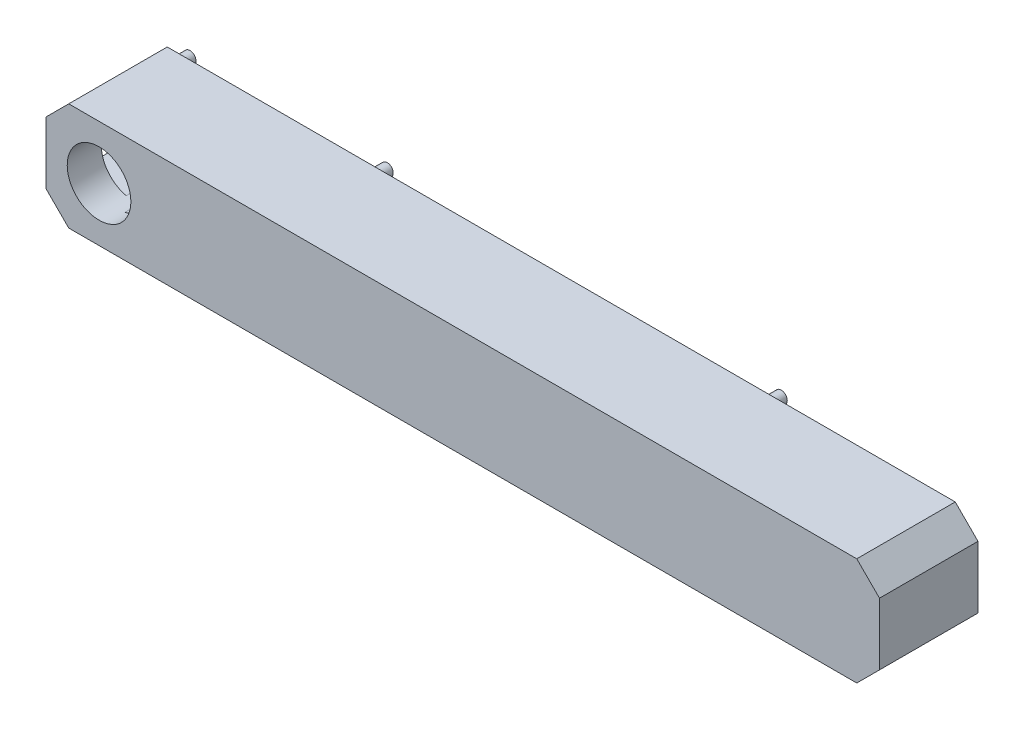
ISO-10303-21;
HEADER;
FILE_DESCRIPTION(('STEP AP214'),'2;1');
FILE_NAME('part.step','',(''),(''),'','','');
FILE_SCHEMA(('AUTOMOTIVE_DESIGN { 1 0 10303 214 1 1 1 1 }'));
ENDSEC;
DATA;
#1=APPLICATION_CONTEXT('core data for automotive mechanical design processes');
#2=APPLICATION_PROTOCOL_DEFINITION('international standard','automotive_design',2000,#1);
#3=PRODUCT_CONTEXT('',#1,'mechanical');
#4=PRODUCT('Part','Part','',(#3));
#5=PRODUCT_RELATED_PRODUCT_CATEGORY('part','',(#4));
#6=PRODUCT_DEFINITION_FORMATION('','',#4);
#7=PRODUCT_DEFINITION_CONTEXT('part definition',#1,'design');
#8=PRODUCT_DEFINITION('design','',#6,#7);
#9=PRODUCT_DEFINITION_SHAPE('','',#8);
#10=(LENGTH_UNIT() NAMED_UNIT(*) SI_UNIT(.MILLI.,.METRE.));
#11=(NAMED_UNIT(*) PLANE_ANGLE_UNIT() SI_UNIT($,.RADIAN.));
#12=(NAMED_UNIT(*) SI_UNIT($,.STERADIAN.) SOLID_ANGLE_UNIT());
#13=UNCERTAINTY_MEASURE_WITH_UNIT(LENGTH_MEASURE(1.E-05),#10,'distance_accuracy_value','');
#14=(GEOMETRIC_REPRESENTATION_CONTEXT(3) GLOBAL_UNCERTAINTY_ASSIGNED_CONTEXT((#13)) GLOBAL_UNIT_ASSIGNED_CONTEXT((#10,
#11,#12)) REPRESENTATION_CONTEXT('',''));
#15=CARTESIAN_POINT('',(0.,0.,0.));
#16=DIRECTION('',(0.,0.,1.));
#17=DIRECTION('',(1.,0.,0.));
#18=AXIS2_PLACEMENT_3D('',#15,#16,#17);
#19=CARTESIAN_POINT('',(-57.0557961783439,0.,2.5));
#20=DIRECTION('',(-1.,0.,0.));
#21=DIRECTION('',(0.,0.,1.));
#22=AXIS2_PLACEMENT_3D('',#19,#20,#21);
#23=PLANE('',#22);
#24=DIRECTION('',(0.,0.,-1.));
#25=VECTOR('',#24,1.);
#26=CARTESIAN_POINT('',(-57.0557961783439,0.,2.5));
#27=LINE('',#26,#25);
#28=CARTESIAN_POINT('',(-57.0557961783439,0.,2.5));
#29=VERTEX_POINT('',#28);
#30=CARTESIAN_POINT('',(-57.0557961783439,0.,-2.));
#31=VERTEX_POINT('',#30);
#32=EDGE_CURVE('E187',#29,#31,#27,.T.);
#33=ORIENTED_EDGE('',*,*,#32,.T.);
#34=DIRECTION('',(0.,-1.,0.));
#35=VECTOR('',#34,1.);
#36=CARTESIAN_POINT('',(-57.0557961783439,0.,-2.));
#37=LINE('',#36,#35);
#38=CARTESIAN_POINT('',(-57.0557961783439,-8.2,-2.));
#39=VERTEX_POINT('',#38);
#40=EDGE_CURVE('E159',#31,#39,#37,.T.);
#41=ORIENTED_EDGE('',*,*,#40,.T.);
#42=DIRECTION('',(0.,0.,-1.));
#43=VECTOR('',#42,1.);
#44=CARTESIAN_POINT('',(-57.0557961783439,-8.2,2.5));
#45=LINE('',#44,#43);
#46=CARTESIAN_POINT('',(-57.0557961783439,-8.2,2.5));
#47=VERTEX_POINT('',#46);
#48=EDGE_CURVE('E179',#47,#39,#45,.T.);
#49=ORIENTED_EDGE('',*,*,#48,.F.);
#50=DIRECTION('',(0.,1.,0.));
#51=VECTOR('',#50,1.);
#52=CARTESIAN_POINT('',(-57.0557961783439,0.,2.5));
#53=LINE('',#52,#51);
#54=EDGE_CURVE('E325',#47,#29,#53,.T.);
#55=ORIENTED_EDGE('',*,*,#54,.T.);
#56=EDGE_LOOP('',(#33,#41,#49,#55));
#57=FACE_BOUND('',#56,.T.);
#58=ADVANCED_FACE('F45',(#57),#23,.T.);
#59=CARTESIAN_POINT('',(-50.0557961783439,-4.1,2.5));
#60=DIRECTION('',(0.,0.,-1.));
#61=DIRECTION('',(-1.,0.,0.));
#62=AXIS2_PLACEMENT_3D('',#59,#60,#61);
#63=CYLINDRICAL_SURFACE('',#62,4.2);
#64=DIRECTION('',(0.,0.,-1.));
#65=VECTOR('',#64,1.);
#66=CARTESIAN_POINT('',(-50.9668395362584,0.,2.5));
#67=LINE('',#66,#65);
#68=CARTESIAN_POINT('',(-50.9668395362584,0.,-10.5));
#69=VERTEX_POINT('',#68);
#70=CARTESIAN_POINT('',(-50.9668395362584,0.,-2.));
#71=VERTEX_POINT('',#70);
#72=EDGE_CURVE('E459',#69,#71,#67,.F.);
#73=ORIENTED_EDGE('',*,*,#72,.F.);
#74=CARTESIAN_POINT('',(-50.0557961783439,-4.1,-10.5));
#75=DIRECTION('',(0.,0.,1.));
#76=DIRECTION('',(1.,0.,0.));
#77=AXIS2_PLACEMENT_3D('',#74,#75,#76);
#78=CIRCLE('',#77,4.2);
#79=CARTESIAN_POINT('',(-49.1447528204295,0.,-10.5));
#80=VERTEX_POINT('',#79);
#81=EDGE_CURVE('E236',#80,#69,#78,.T.);
#82=ORIENTED_EDGE('',*,*,#81,.F.);
#83=DIRECTION('',(0.,0.,1.));
#84=VECTOR('',#83,1.);
#85=CARTESIAN_POINT('',(-49.1447528204295,0.,-10.5));
#86=LINE('',#85,#84);
#87=CARTESIAN_POINT('',(-49.1447528204295,0.,0.));
#88=VERTEX_POINT('',#87);
#89=EDGE_CURVE('E278',#80,#88,#86,.T.);
#90=ORIENTED_EDGE('',*,*,#89,.T.);
#91=CARTESIAN_POINT('',(-50.0557961783439,-4.1,0.));
#92=DIRECTION('',(0.,0.,1.));
#93=DIRECTION('',(1.,0.,0.));
#94=AXIS2_PLACEMENT_3D('',#91,#92,#93);
#95=CIRCLE('',#94,4.2);
#96=CARTESIAN_POINT('',(-49.1447528204295,-8.2,0.));
#97=VERTEX_POINT('',#96);
#98=EDGE_CURVE('E292',#97,#88,#95,.T.);
#99=ORIENTED_EDGE('',*,*,#98,.F.);
#100=DIRECTION('',(0.,0.,1.));
#101=VECTOR('',#100,1.);
#102=CARTESIAN_POINT('',(-49.1447528204295,-8.2,-10.5));
#103=LINE('',#102,#101);
#104=CARTESIAN_POINT('',(-49.1447528204295,-8.2,-10.5));
#105=VERTEX_POINT('',#104);
#106=EDGE_CURVE('E289',#105,#97,#103,.T.);
#107=ORIENTED_EDGE('',*,*,#106,.F.);
#108=CARTESIAN_POINT('',(-50.9668395362584,-8.2,-10.5));
#109=VERTEX_POINT('',#108);
#110=EDGE_CURVE('E241',#109,#105,#78,.T.);
#111=ORIENTED_EDGE('',*,*,#110,.F.);
#112=DIRECTION('',(0.,0.,-1.));
#113=VECTOR('',#112,1.);
#114=CARTESIAN_POINT('',(-50.9668395362584,-8.2,2.5));
#115=LINE('',#114,#113);
#116=CARTESIAN_POINT('',(-50.9668395362584,-8.2,-2.));
#117=VERTEX_POINT('',#116);
#118=EDGE_CURVE('E443',#117,#109,#115,.T.);
#119=ORIENTED_EDGE('',*,*,#118,.F.);
#120=CARTESIAN_POINT('',(-50.0557961783439,-4.1,-2.));
#121=DIRECTION('',(0.,0.,-1.));
#122=DIRECTION('',(-1.,0.,0.));
#123=AXIS2_PLACEMENT_3D('',#120,#121,#122);
#124=CIRCLE('',#123,4.2);
#125=EDGE_CURVE('E160',#117,#71,#124,.T.);
#126=ORIENTED_EDGE('',*,*,#125,.T.);
#127=EDGE_LOOP('',(#73,#82,#90,#99,#107,#111,#119,#126));
#128=FACE_BOUND('',#127,.T.);
#129=CARTESIAN_POINT('',(-50.0557961783439,-4.1,2.5));
#130=DIRECTION('',(0.,0.,1.));
#131=DIRECTION('',(1.,0.,0.));
#132=AXIS2_PLACEMENT_3D('',#129,#130,#131);
#133=CIRCLE('',#132,4.2);
#134=CARTESIAN_POINT('',(-45.8557961783439,-4.1,2.5));
#135=VERTEX_POINT('',#134);
#136=EDGE_CURVE('E302',#135,#135,#133,.T.);
#137=ORIENTED_EDGE('',*,*,#136,.T.);
#138=EDGE_LOOP('',(#137));
#139=FACE_BOUND('',#138,.T.);
#140=ADVANCED_FACE('F47',(#128,#139),#63,.F.);
#141=CARTESIAN_POINT('',(30.5721019108281,-30.572101910828,2.5));
#142=DIRECTION('',(0.707106781186548,-0.707106781186547,0.));
#143=DIRECTION('',(0.707106781186547,0.707106781186548,0.));
#144=AXIS2_PLACEMENT_3D('',#141,#142,#143);
#145=PLANE('',#144);
#146=DIRECTION('',(0.,0.,-1.));
#147=VECTOR('',#146,1.);
#148=CARTESIAN_POINT('',(49.9442038216561,-11.2,2.5));
#149=LINE('',#148,#147);
#150=CARTESIAN_POINT('',(49.9442038216561,-11.2,2.5));
#151=VERTEX_POINT('',#150);
#152=CARTESIAN_POINT('',(49.9442038216561,-11.2,-10.5));
#153=VERTEX_POINT('',#152);
#154=EDGE_CURVE('E334',#151,#153,#149,.T.);
#155=ORIENTED_EDGE('',*,*,#154,.T.);
#156=DIRECTION('',(-0.707106781186547,-0.707106781186548,0.));
#157=VECTOR('',#156,1.);
#158=CARTESIAN_POINT('',(30.5721019108281,-30.572101910828,-10.5));
#159=LINE('',#158,#157);
#160=CARTESIAN_POINT('',(52.9442038216561,-8.2,-10.5));
#161=VERTEX_POINT('',#160);
#162=EDGE_CURVE('E251',#161,#153,#159,.T.);
#163=ORIENTED_EDGE('',*,*,#162,.F.);
#164=DIRECTION('',(0.,0.,-1.));
#165=VECTOR('',#164,1.);
#166=CARTESIAN_POINT('',(52.9442038216561,-8.2,2.5));
#167=LINE('',#166,#165);
#168=CARTESIAN_POINT('',(52.9442038216561,-8.2,2.5));
#169=VERTEX_POINT('',#168);
#170=EDGE_CURVE('E352',#169,#161,#167,.T.);
#171=ORIENTED_EDGE('',*,*,#170,.F.);
#172=DIRECTION('',(-0.707106781186547,-0.707106781186548,0.));
#173=VECTOR('',#172,1.);
#174=CARTESIAN_POINT('',(30.5721019108281,-30.572101910828,2.5));
#175=LINE('',#174,#173);
#176=EDGE_CURVE('E306',#169,#151,#175,.T.);
#177=ORIENTED_EDGE('',*,*,#176,.T.);
#178=EDGE_LOOP('',(#155,#163,#171,#177));
#179=FACE_BOUND('',#178,.T.);
#180=ADVANCED_FACE('F397',(#179),#145,.T.);
#181=CARTESIAN_POINT('',(52.9442038216561,0.,2.5));
#182=DIRECTION('',(1.,0.,0.));
#183=DIRECTION('',(0.,0.,-1.));
#184=AXIS2_PLACEMENT_3D('',#181,#182,#183);
#185=PLANE('',#184);
#186=ORIENTED_EDGE('',*,*,#170,.T.);
#187=DIRECTION('',(0.,-1.,0.));
#188=VECTOR('',#187,1.);
#189=CARTESIAN_POINT('',(52.9442038216561,0.,-10.5));
#190=LINE('',#189,#188);
#191=CARTESIAN_POINT('',(52.9442038216561,0.,-10.5));
#192=VERTEX_POINT('',#191);
#193=EDGE_CURVE('E255',#192,#161,#190,.T.);
#194=ORIENTED_EDGE('',*,*,#193,.F.);
#195=DIRECTION('',(0.,0.,-1.));
#196=VECTOR('',#195,1.);
#197=CARTESIAN_POINT('',(52.9442038216561,0.,2.5));
#198=LINE('',#197,#196);
#199=CARTESIAN_POINT('',(52.9442038216561,0.,2.5));
#200=VERTEX_POINT('',#199);
#201=EDGE_CURVE('E349',#200,#192,#198,.T.);
#202=ORIENTED_EDGE('',*,*,#201,.F.);
#203=DIRECTION('',(0.,-1.,0.));
#204=VECTOR('',#203,1.);
#205=CARTESIAN_POINT('',(52.9442038216561,0.,2.5));
#206=LINE('',#205,#204);
#207=EDGE_CURVE('E310',#200,#169,#206,.T.);
#208=ORIENTED_EDGE('',*,*,#207,.T.);
#209=EDGE_LOOP('',(#186,#194,#202,#208));
#210=FACE_BOUND('',#209,.T.);
#211=ADVANCED_FACE('F413',(#210),#185,.T.);
#212=CARTESIAN_POINT('',(26.472101910828,26.472101910828,2.5));
#213=DIRECTION('',(0.707106781186547,0.707106781186548,0.));
#214=DIRECTION('',(-0.707106781186548,0.707106781186547,0.));
#215=AXIS2_PLACEMENT_3D('',#212,#213,#214);
#216=PLANE('',#215);
#217=ORIENTED_EDGE('',*,*,#201,.T.);
#218=DIRECTION('',(0.707106781186548,-0.707106781186547,0.));
#219=VECTOR('',#218,1.);
#220=CARTESIAN_POINT('',(26.472101910828,26.472101910828,-10.5));
#221=LINE('',#220,#219);
#222=CARTESIAN_POINT('',(49.9442038216561,3.,-10.5));
#223=VERTEX_POINT('',#222);
#224=EDGE_CURVE('E259',#223,#192,#221,.T.);
#225=ORIENTED_EDGE('',*,*,#224,.F.);
#226=DIRECTION('',(0.,0.,-1.));
#227=VECTOR('',#226,1.);
#228=CARTESIAN_POINT('',(49.9442038216561,3.,2.5));
#229=LINE('',#228,#227);
#230=CARTESIAN_POINT('',(49.9442038216561,3.,2.5));
#231=VERTEX_POINT('',#230);
#232=EDGE_CURVE('E346',#231,#223,#229,.T.);
#233=ORIENTED_EDGE('',*,*,#232,.F.);
#234=DIRECTION('',(0.707106781186548,-0.707106781186547,0.));
#235=VECTOR('',#234,1.);
#236=CARTESIAN_POINT('',(26.472101910828,26.472101910828,2.5));
#237=LINE('',#236,#235);
#238=EDGE_CURVE('E314',#231,#200,#237,.T.);
#239=ORIENTED_EDGE('',*,*,#238,.T.);
#240=EDGE_LOOP('',(#217,#225,#233,#239));
#241=FACE_BOUND('',#240,.T.);
#242=ADVANCED_FACE('F409',(#241),#216,.T.);
#243=CARTESIAN_POINT('',(0.,2.99999999999999,2.5));
#244=DIRECTION('',(0.,-1.,0.));
#245=DIRECTION('',(1.,0.,0.));
#246=AXIS2_PLACEMENT_3D('',#243,#244,#245);
#247=PLANE('',#246);
#248=ORIENTED_EDGE('',*,*,#232,.T.);
#249=DIRECTION('',(-1.,0.,0.));
#250=VECTOR('',#249,1.);
#251=CARTESIAN_POINT('',(0.,2.99999999999999,-10.5));
#252=LINE('',#251,#250);
#253=CARTESIAN_POINT('',(-54.0557961783439,2.99999999999999,-10.5));
#254=VERTEX_POINT('',#253);
#255=EDGE_CURVE('E263',#223,#254,#252,.T.);
#256=ORIENTED_EDGE('',*,*,#255,.T.);
#257=DIRECTION('',(0.,0.,-1.));
#258=VECTOR('',#257,1.);
#259=CARTESIAN_POINT('',(-54.0557961783439,2.99999999999999,2.5));
#260=LINE('',#259,#258);
#261=CARTESIAN_POINT('',(-54.0557961783439,2.99999999999999,2.5));
#262=VERTEX_POINT('',#261);
#263=EDGE_CURVE('E343',#262,#254,#260,.T.);
#264=ORIENTED_EDGE('',*,*,#263,.F.);
#265=DIRECTION('',(-1.,0.,0.));
#266=VECTOR('',#265,1.);
#267=CARTESIAN_POINT('',(0.,2.99999999999999,2.5));
#268=LINE('',#267,#266);
#269=EDGE_CURVE('E318',#231,#262,#268,.T.);
#270=ORIENTED_EDGE('',*,*,#269,.F.);
#271=EDGE_LOOP('',(#248,#256,#264,#270));
#272=FACE_BOUND('',#271,.T.);
#273=ADVANCED_FACE('F405',(#272),#247,.F.);
#274=CARTESIAN_POINT('',(-28.5278980891718,28.527898089172,2.5));
#275=DIRECTION('',(0.707106781186546,-0.707106781186549,0.));
#276=DIRECTION('',(0.707106781186549,0.707106781186546,0.));
#277=AXIS2_PLACEMENT_3D('',#274,#275,#276);
#278=PLANE('',#277);
#279=ORIENTED_EDGE('',*,*,#263,.T.);
#280=DIRECTION('',(-0.707106781186549,-0.707106781186546,0.));
#281=VECTOR('',#280,1.);
#282=CARTESIAN_POINT('',(-28.5278980891718,28.527898089172,-10.5));
#283=LINE('',#282,#281);
#284=CARTESIAN_POINT('',(-57.0557961783439,0.,-10.5));
#285=VERTEX_POINT('',#284);
#286=EDGE_CURVE('E267',#254,#285,#283,.T.);
#287=ORIENTED_EDGE('',*,*,#286,.T.);
#288=DIRECTION('',(0.,0.,-1.));
#289=VECTOR('',#288,1.);
#290=CARTESIAN_POINT('',(-57.0557961783439,0.,0.));
#291=LINE('',#290,#289);
#292=EDGE_CURVE('E176',#31,#285,#291,.T.);
#293=ORIENTED_EDGE('',*,*,#292,.F.);
#294=ORIENTED_EDGE('',*,*,#32,.F.);
#295=DIRECTION('',(-0.707106781186549,-0.707106781186546,0.));
#296=VECTOR('',#295,1.);
#297=CARTESIAN_POINT('',(-28.5278980891718,28.527898089172,2.5));
#298=LINE('',#297,#296);
#299=EDGE_CURVE('E322',#262,#29,#298,.T.);
#300=ORIENTED_EDGE('',*,*,#299,.F.);
#301=EDGE_LOOP('',(#279,#287,#293,#294,#300));
#302=FACE_BOUND('',#301,.T.);
#303=ADVANCED_FACE('F402',(#302),#278,.F.);
#304=CARTESIAN_POINT('',(-32.6278980891719,-32.627898089172,2.5));
#305=DIRECTION('',(0.707106781186547,0.707106781186548,0.));
#306=DIRECTION('',(-0.707106781186548,0.707106781186547,0.));
#307=AXIS2_PLACEMENT_3D('',#304,#305,#306);
#308=PLANE('',#307);
#309=ORIENTED_EDGE('',*,*,#48,.T.);
#310=DIRECTION('',(0.,0.,1.));
#311=VECTOR('',#310,1.);
#312=CARTESIAN_POINT('',(-57.0557961783439,-8.2,0.));
#313=LINE('',#312,#311);
#314=CARTESIAN_POINT('',(-57.0557961783439,-8.2,-10.5));
#315=VERTEX_POINT('',#314);
#316=EDGE_CURVE('E167',#315,#39,#313,.T.);
#317=ORIENTED_EDGE('',*,*,#316,.F.);
#318=DIRECTION('',(0.707106781186548,-0.707106781186547,0.));
#319=VECTOR('',#318,1.);
#320=CARTESIAN_POINT('',(-32.6278980891719,-32.627898089172,-10.5));
#321=LINE('',#320,#319);
#322=CARTESIAN_POINT('',(-54.0557961783439,-11.2,-10.5));
#323=VERTEX_POINT('',#322);
#324=EDGE_CURVE('E271',#315,#323,#321,.T.);
#325=ORIENTED_EDGE('',*,*,#324,.T.);
#326=DIRECTION('',(0.,0.,-1.));
#327=VECTOR('',#326,1.);
#328=CARTESIAN_POINT('',(-54.0557961783439,-11.2,2.5));
#329=LINE('',#328,#327);
#330=CARTESIAN_POINT('',(-54.0557961783439,-11.2,2.5));
#331=VERTEX_POINT('',#330);
#332=EDGE_CURVE('E188',#331,#323,#329,.T.);
#333=ORIENTED_EDGE('',*,*,#332,.F.);
#334=DIRECTION('',(0.707106781186548,-0.707106781186547,0.));
#335=VECTOR('',#334,1.);
#336=CARTESIAN_POINT('',(-32.6278980891719,-32.627898089172,2.5));
#337=LINE('',#336,#335);
#338=EDGE_CURVE('E182',#47,#331,#337,.T.);
#339=ORIENTED_EDGE('',*,*,#338,.F.);
#340=EDGE_LOOP('',(#309,#317,#325,#333,#339));
#341=FACE_BOUND('',#340,.T.);
#342=ADVANCED_FACE('F180',(#341),#308,.F.);
#343=CARTESIAN_POINT('',(0.,-11.2,2.5));
#344=DIRECTION('',(0.,-1.,0.));
#345=DIRECTION('',(0.,0.,-1.));
#346=AXIS2_PLACEMENT_3D('',#343,#344,#345);
#347=PLANE('',#346);
#348=ORIENTED_EDGE('',*,*,#332,.T.);
#349=DIRECTION('',(-1.,0.,0.));
#350=VECTOR('',#349,1.);
#351=CARTESIAN_POINT('',(0.,-11.2,-10.5));
#352=LINE('',#351,#350);
#353=EDGE_CURVE('E274',#153,#323,#352,.T.);
#354=ORIENTED_EDGE('',*,*,#353,.F.);
#355=ORIENTED_EDGE('',*,*,#154,.F.);
#356=DIRECTION('',(-1.,0.,0.));
#357=VECTOR('',#356,1.);
#358=CARTESIAN_POINT('',(0.,-11.2,2.5));
#359=LINE('',#358,#357);
#360=EDGE_CURVE('E330',#151,#331,#359,.T.);
#361=ORIENTED_EDGE('',*,*,#360,.T.);
#362=EDGE_LOOP('',(#348,#354,#355,#361));
#363=FACE_BOUND('',#362,.T.);
#364=ADVANCED_FACE('F426',(#363),#347,.T.);
#365=CARTESIAN_POINT('',(0.,0.,2.5));
#366=DIRECTION('',(0.,0.,1.));
#367=DIRECTION('',(1.,0.,0.));
#368=AXIS2_PLACEMENT_3D('',#365,#366,#367);
#369=PLANE('',#368);
#370=ORIENTED_EDGE('',*,*,#136,.F.);
#371=EDGE_LOOP('',(#370));
#372=FACE_BOUND('',#371,.T.);
#373=ORIENTED_EDGE('',*,*,#176,.F.);
#374=ORIENTED_EDGE('',*,*,#207,.F.);
#375=ORIENTED_EDGE('',*,*,#238,.F.);
#376=ORIENTED_EDGE('',*,*,#269,.T.);
#377=ORIENTED_EDGE('',*,*,#299,.T.);
#378=ORIENTED_EDGE('',*,*,#54,.F.);
#379=ORIENTED_EDGE('',*,*,#338,.T.);
#380=ORIENTED_EDGE('',*,*,#360,.F.);
#381=EDGE_LOOP('',(#373,#374,#375,#376,#377,#378,#379,#380));
#382=FACE_BOUND('',#381,.T.);
#383=ADVANCED_FACE('F434',(#372,#382),#369,.T.);
#384=CARTESIAN_POINT('',(0.,0.,0.));
#385=DIRECTION('',(0.,0.,1.));
#386=DIRECTION('',(1.,0.,0.));
#387=AXIS2_PLACEMENT_3D('',#384,#385,#386);
#388=PLANE('',#387);
#389=ORIENTED_EDGE('',*,*,#98,.T.);
#390=DIRECTION('',(1.,0.,0.));
#391=VECTOR('',#390,1.);
#392=CARTESIAN_POINT('',(0.,0.,0.));
#393=LINE('',#392,#391);
#394=CARTESIAN_POINT('',(49.9442038216561,0.,0.));
#395=VERTEX_POINT('',#394);
#396=EDGE_CURVE('E69',#88,#395,#393,.T.);
#397=ORIENTED_EDGE('',*,*,#396,.T.);
#398=DIRECTION('',(0.,1.,0.));
#399=VECTOR('',#398,1.);
#400=CARTESIAN_POINT('',(49.9442038216561,0.,0.));
#401=LINE('',#400,#399);
#402=CARTESIAN_POINT('',(49.9442038216561,-8.2,0.));
#403=VERTEX_POINT('',#402);
#404=EDGE_CURVE('E281',#403,#395,#401,.T.);
#405=ORIENTED_EDGE('',*,*,#404,.F.);
#406=DIRECTION('',(1.,0.,0.));
#407=VECTOR('',#406,1.);
#408=CARTESIAN_POINT('',(0.,-8.2,0.));
#409=LINE('',#408,#407);
#410=EDGE_CURVE('E285',#97,#403,#409,.T.);
#411=ORIENTED_EDGE('',*,*,#410,.F.);
#412=EDGE_LOOP('',(#389,#397,#405,#411));
#413=FACE_BOUND('',#412,.T.);
#414=ADVANCED_FACE('F450',(#413),#388,.F.);
#415=CARTESIAN_POINT('',(0.,-8.2,-10.5));
#416=DIRECTION('',(0.,-1.,0.));
#417=DIRECTION('',(0.,0.,-1.));
#418=AXIS2_PLACEMENT_3D('',#415,#416,#417);
#419=PLANE('',#418);
#420=ORIENTED_EDGE('',*,*,#106,.T.);
#421=ORIENTED_EDGE('',*,*,#410,.T.);
#422=DIRECTION('',(0.,0.,1.));
#423=VECTOR('',#422,1.);
#424=CARTESIAN_POINT('',(49.9442038216561,-8.2,-10.5));
#425=LINE('',#424,#423);
#426=CARTESIAN_POINT('',(49.9442038216561,-8.2,-10.5));
#427=VERTEX_POINT('',#426);
#428=EDGE_CURVE('E293',#427,#403,#425,.T.);
#429=ORIENTED_EDGE('',*,*,#428,.F.);
#430=DIRECTION('',(1.,0.,0.));
#431=VECTOR('',#430,1.);
#432=CARTESIAN_POINT('',(0.,-8.2,-10.5));
#433=LINE('',#432,#431);
#434=EDGE_CURVE('E248',#105,#427,#433,.T.);
#435=ORIENTED_EDGE('',*,*,#434,.F.);
#436=EDGE_LOOP('',(#420,#421,#429,#435));
#437=FACE_BOUND('',#436,.T.);
#438=ADVANCED_FACE('F448',(#437),#419,.F.);
#439=CARTESIAN_POINT('',(49.9442038216561,0.,-10.5));
#440=DIRECTION('',(1.,0.,0.));
#441=DIRECTION('',(0.,0.,-1.));
#442=AXIS2_PLACEMENT_3D('',#439,#440,#441);
#443=PLANE('',#442);
#444=ORIENTED_EDGE('',*,*,#404,.T.);
#445=DIRECTION('',(0.,0.,1.));
#446=VECTOR('',#445,1.);
#447=CARTESIAN_POINT('',(49.9442038216561,0.,-10.5));
#448=LINE('',#447,#446);
#449=CARTESIAN_POINT('',(49.9442038216561,0.,-10.5));
#450=VERTEX_POINT('',#449);
#451=EDGE_CURVE('E297',#450,#395,#448,.T.);
#452=ORIENTED_EDGE('',*,*,#451,.F.);
#453=DIRECTION('',(0.,1.,0.));
#454=VECTOR('',#453,1.);
#455=CARTESIAN_POINT('',(49.9442038216561,0.,-10.5));
#456=LINE('',#455,#454);
#457=EDGE_CURVE('E244',#427,#450,#456,.T.);
#458=ORIENTED_EDGE('',*,*,#457,.F.);
#459=ORIENTED_EDGE('',*,*,#428,.T.);
#460=EDGE_LOOP('',(#444,#452,#458,#459));
#461=FACE_BOUND('',#460,.T.);
#462=ADVANCED_FACE('F453',(#461),#443,.F.);
#463=CARTESIAN_POINT('',(0.,0.,-10.5));
#464=DIRECTION('',(0.,-1.,0.));
#465=DIRECTION('',(0.,0.,-1.));
#466=AXIS2_PLACEMENT_3D('',#463,#464,#465);
#467=PLANE('',#466);
#468=ORIENTED_EDGE('',*,*,#396,.F.);
#469=ORIENTED_EDGE('',*,*,#89,.F.);
#470=DIRECTION('',(1.,0.,0.));
#471=VECTOR('',#470,1.);
#472=CARTESIAN_POINT('',(0.,0.,-10.5));
#473=LINE('',#472,#471);
#474=EDGE_CURVE('E240',#80,#450,#473,.T.);
#475=ORIENTED_EDGE('',*,*,#474,.T.);
#476=ORIENTED_EDGE('',*,*,#451,.T.);
#477=EDGE_LOOP('',(#468,#469,#475,#476));
#478=FACE_BOUND('',#477,.T.);
#479=ADVANCED_FACE('F372',(#478),#467,.T.);
#480=CARTESIAN_POINT('',(0.,0.,-10.5));
#481=DIRECTION('',(0.,0.,1.));
#482=DIRECTION('',(1.,0.,0.));
#483=AXIS2_PLACEMENT_3D('',#480,#481,#482);
#484=PLANE('',#483);
#485=CARTESIAN_POINT('',(-53.0557961783439,1.29661853126193,-10.5));
#486=DIRECTION('',(0.,0.,1.));
#487=DIRECTION('',(1.,0.,0.));
#488=AXIS2_PLACEMENT_3D('',#485,#486,#487);
#489=CIRCLE('',#488,0.800000000000003);
#490=CARTESIAN_POINT('',(-52.2557961783439,1.29661853126193,-10.5));
#491=VERTEX_POINT('',#490);
#492=EDGE_CURVE('E11',#491,#491,#489,.F.);
#493=ORIENTED_EDGE('',*,*,#492,.F.);
#494=EDGE_LOOP('',(#493));
#495=FACE_BOUND('',#494,.T.);
#496=CARTESIAN_POINT('',(-53.0557961783439,-9.49661853126194,-10.5));
#497=DIRECTION('',(0.,0.,-1.));
#498=DIRECTION('',(-1.,0.,0.));
#499=AXIS2_PLACEMENT_3D('',#496,#497,#498);
#500=CIRCLE('',#499,0.999999999999998);
#501=CARTESIAN_POINT('',(-54.0557961783439,-9.49661853126194,-10.5));
#502=VERTEX_POINT('',#501);
#503=EDGE_CURVE('E466',#502,#502,#500,.T.);
#504=ORIENTED_EDGE('',*,*,#503,.F.);
#505=EDGE_LOOP('',(#504));
#506=FACE_BOUND('',#505,.T.);
#507=ORIENTED_EDGE('',*,*,#81,.T.);
#508=DIRECTION('',(-1.,0.,0.));
#509=VECTOR('',#508,1.);
#510=CARTESIAN_POINT('',(-47.0557961783439,0.,-10.5));
#511=LINE('',#510,#509);
#512=EDGE_CURVE('E468',#69,#285,#511,.T.);
#513=ORIENTED_EDGE('',*,*,#512,.T.);
#514=ORIENTED_EDGE('',*,*,#286,.F.);
#515=ORIENTED_EDGE('',*,*,#255,.F.);
#516=ORIENTED_EDGE('',*,*,#224,.T.);
#517=ORIENTED_EDGE('',*,*,#193,.T.);
#518=ORIENTED_EDGE('',*,*,#162,.T.);
#519=ORIENTED_EDGE('',*,*,#353,.T.);
#520=ORIENTED_EDGE('',*,*,#324,.F.);
#521=DIRECTION('',(-1.,0.,0.));
#522=VECTOR('',#521,1.);
#523=CARTESIAN_POINT('',(-47.0557961783439,-8.2,-10.5));
#524=LINE('',#523,#522);
#525=EDGE_CURVE('E164',#109,#315,#524,.T.);
#526=ORIENTED_EDGE('',*,*,#525,.F.);
#527=ORIENTED_EDGE('',*,*,#110,.T.);
#528=ORIENTED_EDGE('',*,*,#434,.T.);
#529=ORIENTED_EDGE('',*,*,#457,.T.);
#530=ORIENTED_EDGE('',*,*,#474,.F.);
#531=EDGE_LOOP('',(#507,#513,#514,#515,#516,#517,#518,#519,#520,#526,#527,#528,#529,#530));
#532=FACE_BOUND('',#531,.T.);
#533=CARTESIAN_POINT('',(25.1719646611347,-9.7,-10.5));
#534=DIRECTION('',(0.,0.,-1.));
#535=DIRECTION('',(-1.,0.,0.));
#536=AXIS2_PLACEMENT_3D('',#533,#534,#535);
#537=CIRCLE('',#536,1.);
#538=CARTESIAN_POINT('',(24.1719646611347,-9.7,-10.5));
#539=VERTEX_POINT('',#538);
#540=EDGE_CURVE('E206',#539,#539,#537,.T.);
#541=ORIENTED_EDGE('',*,*,#540,.F.);
#542=EDGE_LOOP('',(#541));
#543=FACE_BOUND('',#542,.T.);
#544=CARTESIAN_POINT('',(-26.8280353388653,-9.7,-10.5));
#545=DIRECTION('',(0.,0.,-1.));
#546=DIRECTION('',(-1.,0.,0.));
#547=AXIS2_PLACEMENT_3D('',#544,#545,#546);
#548=CIRCLE('',#547,1.);
#549=CARTESIAN_POINT('',(-27.8280353388653,-9.7,-10.5));
#550=VERTEX_POINT('',#549);
#551=EDGE_CURVE('E175',#550,#550,#548,.T.);
#552=ORIENTED_EDGE('',*,*,#551,.F.);
#553=EDGE_LOOP('',(#552));
#554=FACE_BOUND('',#553,.T.);
#555=CARTESIAN_POINT('',(-27.027898089172,1.49999999999999,-10.5));
#556=DIRECTION('',(0.,0.,1.));
#557=DIRECTION('',(1.,0.,0.));
#558=AXIS2_PLACEMENT_3D('',#555,#556,#557);
#559=CIRCLE('',#558,0.799999999999999);
#560=CARTESIAN_POINT('',(-26.227898089172,1.49999999999999,-10.5));
#561=VERTEX_POINT('',#560);
#562=EDGE_CURVE('E54',#561,#561,#559,.F.);
#563=ORIENTED_EDGE('',*,*,#562,.F.);
#564=EDGE_LOOP('',(#563));
#565=FACE_BOUND('',#564,.T.);
#566=CARTESIAN_POINT('',(24.972101910828,1.5,-10.5));
#567=DIRECTION('',(0.,0.,1.));
#568=DIRECTION('',(1.,0.,0.));
#569=AXIS2_PLACEMENT_3D('',#566,#567,#568);
#570=CIRCLE('',#569,0.799999999999999);
#571=CARTESIAN_POINT('',(25.772101910828,1.5,-10.5));
#572=VERTEX_POINT('',#571);
#573=EDGE_CURVE('E359',#572,#572,#570,.F.);
#574=ORIENTED_EDGE('',*,*,#573,.F.);
#575=EDGE_LOOP('',(#574));
#576=FACE_BOUND('',#575,.T.);
#577=CARTESIAN_POINT('',(0.399725500613287,-9.69999999999999,-10.5));
#578=DIRECTION('',(0.,0.,1.));
#579=DIRECTION('',(1.,0.,0.));
#580=AXIS2_PLACEMENT_3D('',#577,#578,#579);
#581=CIRCLE('',#580,0.8);
#582=CARTESIAN_POINT('',(1.19972550061329,-9.69999999999999,-10.5));
#583=VERTEX_POINT('',#582);
#584=EDGE_CURVE('E355',#583,#583,#581,.F.);
#585=ORIENTED_EDGE('',*,*,#584,.F.);
#586=EDGE_LOOP('',(#585));
#587=FACE_BOUND('',#586,.T.);
#588=CARTESIAN_POINT('',(-0.0557961783439302,1.5,-10.5));
#589=DIRECTION('',(0.,0.,-1.));
#590=DIRECTION('',(-1.,0.,0.));
#591=AXIS2_PLACEMENT_3D('',#588,#589,#590);
#592=CIRCLE('',#591,1.);
#593=CARTESIAN_POINT('',(-1.05579617834393,1.5,-10.5));
#594=VERTEX_POINT('',#593);
#595=EDGE_CURVE('E228',#594,#594,#592,.T.);
#596=ORIENTED_EDGE('',*,*,#595,.F.);
#597=EDGE_LOOP('',(#596));
#598=FACE_BOUND('',#597,.T.);
#599=ADVANCED_FACE('F368',(#495,#506,#532,#543,#554,#565,#576,#587,#598),#484,.F.);
#600=CARTESIAN_POINT('',(-0.0557961783439302,1.5,-8.5));
#601=DIRECTION('',(0.,0.,-1.));
#602=DIRECTION('',(-1.,0.,0.));
#603=AXIS2_PLACEMENT_3D('',#600,#601,#602);
#604=CYLINDRICAL_SURFACE('',#603,1.);
#605=CARTESIAN_POINT('',(-0.0557961783439302,1.5,-8.5));
#606=DIRECTION('',(0.,0.,-1.));
#607=DIRECTION('',(-1.,0.,0.));
#608=AXIS2_PLACEMENT_3D('',#605,#606,#607);
#609=CIRCLE('',#608,1.);
#610=CARTESIAN_POINT('',(-1.05579617834393,1.5,-8.5));
#611=VERTEX_POINT('',#610);
#612=EDGE_CURVE('E229',#611,#611,#609,.T.);
#613=ORIENTED_EDGE('',*,*,#612,.F.);
#614=EDGE_LOOP('',(#613));
#615=FACE_BOUND('',#614,.T.);
#616=ORIENTED_EDGE('',*,*,#595,.T.);
#617=EDGE_LOOP('',(#616));
#618=FACE_BOUND('',#617,.T.);
#619=ADVANCED_FACE('F371',(#615,#618),#604,.F.);
#620=CARTESIAN_POINT('',(-0.0557961783439302,1.5,-8.5));
#621=DIRECTION('',(0.,0.,-1.));
#622=DIRECTION('',(-1.,0.,0.));
#623=AXIS2_PLACEMENT_3D('',#620,#621,#622);
#624=PLANE('',#623);
#625=ORIENTED_EDGE('',*,*,#612,.T.);
#626=EDGE_LOOP('',(#625));
#627=FACE_BOUND('',#626,.T.);
#628=ADVANCED_FACE('F382',(#627),#624,.T.);
#629=CARTESIAN_POINT('',(0.399725500613287,-9.69999999999999,-12.5));
#630=DIRECTION('',(0.,0.,1.));
#631=DIRECTION('',(1.,0.,0.));
#632=AXIS2_PLACEMENT_3D('',#629,#630,#631);
#633=CYLINDRICAL_SURFACE('',#632,0.8);
#634=CARTESIAN_POINT('',(0.399725500613287,-9.69999999999999,-12.5));
#635=DIRECTION('',(0.,0.,-1.));
#636=DIRECTION('',(-1.,0.,0.));
#637=AXIS2_PLACEMENT_3D('',#634,#635,#636);
#638=CIRCLE('',#637,0.8);
#639=CARTESIAN_POINT('',(-0.400274499386713,-9.69999999999999,-12.5));
#640=VERTEX_POINT('',#639);
#641=EDGE_CURVE('E224',#640,#640,#638,.T.);
#642=ORIENTED_EDGE('',*,*,#641,.F.);
#643=EDGE_LOOP('',(#642));
#644=FACE_BOUND('',#643,.T.);
#645=ORIENTED_EDGE('',*,*,#584,.T.);
#646=EDGE_LOOP('',(#645));
#647=FACE_BOUND('',#646,.T.);
#648=ADVANCED_FACE('F388',(#644,#647),#633,.T.);
#649=CARTESIAN_POINT('',(0.,0.,-12.5));
#650=DIRECTION('',(0.,0.,-1.));
#651=DIRECTION('',(-1.,0.,0.));
#652=AXIS2_PLACEMENT_3D('',#649,#650,#651);
#653=PLANE('',#652);
#654=ORIENTED_EDGE('',*,*,#641,.T.);
#655=EDGE_LOOP('',(#654));
#656=FACE_BOUND('',#655,.T.);
#657=ADVANCED_FACE('F524',(#656),#653,.T.);
#658=CARTESIAN_POINT('',(24.972101910828,1.5,-12.5));
#659=DIRECTION('',(0.,0.,1.));
#660=DIRECTION('',(1.,0.,0.));
#661=AXIS2_PLACEMENT_3D('',#658,#659,#660);
#662=CYLINDRICAL_SURFACE('',#661,0.799999999999999);
#663=CARTESIAN_POINT('',(24.972101910828,1.5,-12.5));
#664=DIRECTION('',(0.,0.,-1.));
#665=DIRECTION('',(-1.,0.,0.));
#666=AXIS2_PLACEMENT_3D('',#663,#664,#665);
#667=CIRCLE('',#666,0.799999999999999);
#668=CARTESIAN_POINT('',(24.172101910828,1.5,-12.5));
#669=VERTEX_POINT('',#668);
#670=EDGE_CURVE('E220',#669,#669,#667,.T.);
#671=ORIENTED_EDGE('',*,*,#670,.F.);
#672=EDGE_LOOP('',(#671));
#673=FACE_BOUND('',#672,.T.);
#674=ORIENTED_EDGE('',*,*,#573,.T.);
#675=EDGE_LOOP('',(#674));
#676=FACE_BOUND('',#675,.T.);
#677=ADVANCED_FACE('F520',(#673,#676),#662,.T.);
#678=CARTESIAN_POINT('',(0.,0.,-12.5));
#679=DIRECTION('',(0.,0.,-1.));
#680=DIRECTION('',(-1.,0.,0.));
#681=AXIS2_PLACEMENT_3D('',#678,#679,#680);
#682=PLANE('',#681);
#683=ORIENTED_EDGE('',*,*,#670,.T.);
#684=EDGE_LOOP('',(#683));
#685=FACE_BOUND('',#684,.T.);
#686=ADVANCED_FACE('F513',(#685),#682,.T.);
#687=CARTESIAN_POINT('',(-27.027898089172,1.49999999999999,-12.5));
#688=DIRECTION('',(0.,0.,1.));
#689=DIRECTION('',(1.,0.,0.));
#690=AXIS2_PLACEMENT_3D('',#687,#688,#689);
#691=CYLINDRICAL_SURFACE('',#690,0.799999999999999);
#692=CARTESIAN_POINT('',(-27.027898089172,1.49999999999999,-12.5));
#693=DIRECTION('',(0.,0.,-1.));
#694=DIRECTION('',(-1.,0.,0.));
#695=AXIS2_PLACEMENT_3D('',#692,#693,#694);
#696=CIRCLE('',#695,0.799999999999999);
#697=CARTESIAN_POINT('',(-27.827898089172,1.49999999999999,-12.5));
#698=VERTEX_POINT('',#697);
#699=EDGE_CURVE('E205',#698,#698,#696,.T.);
#700=ORIENTED_EDGE('',*,*,#699,.F.);
#701=EDGE_LOOP('',(#700));
#702=FACE_BOUND('',#701,.T.);
#703=ORIENTED_EDGE('',*,*,#562,.T.);
#704=EDGE_LOOP('',(#703));
#705=FACE_BOUND('',#704,.T.);
#706=ADVANCED_FACE('F366',(#702,#705),#691,.T.);
#707=CARTESIAN_POINT('',(-27.027898089172,1.49999999999999,-12.5));
#708=DIRECTION('',(0.,0.,-1.));
#709=DIRECTION('',(-1.,0.,0.));
#710=AXIS2_PLACEMENT_3D('',#707,#708,#709);
#711=PLANE('',#710);
#712=ORIENTED_EDGE('',*,*,#699,.T.);
#713=EDGE_LOOP('',(#712));
#714=FACE_BOUND('',#713,.T.);
#715=ADVANCED_FACE('F509',(#714),#711,.T.);
#716=CARTESIAN_POINT('',(-26.8280353388653,-9.7,-8.5));
#717=DIRECTION('',(0.,0.,-1.));
#718=DIRECTION('',(-1.,0.,0.));
#719=AXIS2_PLACEMENT_3D('',#716,#717,#718);
#720=CYLINDRICAL_SURFACE('',#719,1.);
#721=CARTESIAN_POINT('',(-26.8280353388653,-9.7,-8.5));
#722=DIRECTION('',(0.,0.,-1.));
#723=DIRECTION('',(-1.,0.,0.));
#724=AXIS2_PLACEMENT_3D('',#721,#722,#723);
#725=CIRCLE('',#724,1.);
#726=CARTESIAN_POINT('',(-27.8280353388653,-9.7,-8.5));
#727=VERTEX_POINT('',#726);
#728=EDGE_CURVE('E210',#727,#727,#725,.T.);
#729=ORIENTED_EDGE('',*,*,#728,.F.);
#730=EDGE_LOOP('',(#729));
#731=FACE_BOUND('',#730,.T.);
#732=ORIENTED_EDGE('',*,*,#551,.T.);
#733=EDGE_LOOP('',(#732));
#734=FACE_BOUND('',#733,.T.);
#735=ADVANCED_FACE('F505',(#731,#734),#720,.F.);
#736=CARTESIAN_POINT('',(0.,0.,-8.5));
#737=DIRECTION('',(0.,0.,-1.));
#738=DIRECTION('',(-1.,0.,0.));
#739=AXIS2_PLACEMENT_3D('',#736,#737,#738);
#740=PLANE('',#739);
#741=ORIENTED_EDGE('',*,*,#728,.T.);
#742=EDGE_LOOP('',(#741));
#743=FACE_BOUND('',#742,.T.);
#744=ADVANCED_FACE('F501',(#743),#740,.T.);
#745=CARTESIAN_POINT('',(25.1719646611347,-9.7,-8.5));
#746=DIRECTION('',(0.,0.,-1.));
#747=DIRECTION('',(-1.,0.,0.));
#748=AXIS2_PLACEMENT_3D('',#745,#746,#747);
#749=CYLINDRICAL_SURFACE('',#748,1.);
#750=CARTESIAN_POINT('',(25.1719646611347,-9.7,-8.5));
#751=DIRECTION('',(0.,0.,-1.));
#752=DIRECTION('',(-1.,0.,0.));
#753=AXIS2_PLACEMENT_3D('',#750,#751,#752);
#754=CIRCLE('',#753,1.);
#755=CARTESIAN_POINT('',(24.1719646611347,-9.7,-8.5));
#756=VERTEX_POINT('',#755);
#757=EDGE_CURVE('E201',#756,#756,#754,.T.);
#758=ORIENTED_EDGE('',*,*,#757,.F.);
#759=EDGE_LOOP('',(#758));
#760=FACE_BOUND('',#759,.T.);
#761=ORIENTED_EDGE('',*,*,#540,.T.);
#762=EDGE_LOOP('',(#761));
#763=FACE_BOUND('',#762,.T.);
#764=ADVANCED_FACE('F497',(#760,#763),#749,.F.);
#765=CARTESIAN_POINT('',(0.,0.,-8.5));
#766=DIRECTION('',(0.,0.,-1.));
#767=DIRECTION('',(-1.,0.,0.));
#768=AXIS2_PLACEMENT_3D('',#765,#766,#767);
#769=PLANE('',#768);
#770=ORIENTED_EDGE('',*,*,#757,.T.);
#771=EDGE_LOOP('',(#770));
#772=FACE_BOUND('',#771,.T.);
#773=ADVANCED_FACE('F490',(#772),#769,.T.);
#774=CARTESIAN_POINT('',(-50.0557961783439,-4.1,-2.));
#775=DIRECTION('',(0.,0.,-1.));
#776=DIRECTION('',(-1.,0.,0.));
#777=AXIS2_PLACEMENT_3D('',#774,#775,#776);
#778=PLANE('',#777);
#779=ORIENTED_EDGE('',*,*,#125,.F.);
#780=DIRECTION('',(-1.,0.,0.));
#781=VECTOR('',#780,1.);
#782=CARTESIAN_POINT('',(-47.0557961783439,-8.2,-2.));
#783=LINE('',#782,#781);
#784=EDGE_CURVE('E155',#117,#39,#783,.T.);
#785=ORIENTED_EDGE('',*,*,#784,.T.);
#786=ORIENTED_EDGE('',*,*,#40,.F.);
#787=DIRECTION('',(-1.,0.,0.));
#788=VECTOR('',#787,1.);
#789=CARTESIAN_POINT('',(-47.0557961783439,0.,-2.));
#790=LINE('',#789,#788);
#791=EDGE_CURVE('E61',#71,#31,#790,.T.);
#792=ORIENTED_EDGE('',*,*,#791,.F.);
#793=EDGE_LOOP('',(#779,#785,#786,#792));
#794=FACE_BOUND('',#793,.T.);
#795=ADVANCED_FACE('F157',(#794),#778,.T.);
#796=CARTESIAN_POINT('',(-53.0557961783439,-9.49661853126194,-8.5));
#797=DIRECTION('',(0.,0.,-1.));
#798=DIRECTION('',(-1.,0.,0.));
#799=AXIS2_PLACEMENT_3D('',#796,#797,#798);
#800=CYLINDRICAL_SURFACE('',#799,0.999999999999998);
#801=CARTESIAN_POINT('',(-53.0557961783439,-9.49661853126194,-8.5));
#802=DIRECTION('',(0.,0.,-1.));
#803=DIRECTION('',(-1.,0.,0.));
#804=AXIS2_PLACEMENT_3D('',#801,#802,#803);
#805=CIRCLE('',#804,0.999999999999998);
#806=CARTESIAN_POINT('',(-54.0557961783439,-9.49661853126194,-8.5));
#807=VERTEX_POINT('',#806);
#808=EDGE_CURVE('E197',#807,#807,#805,.T.);
#809=ORIENTED_EDGE('',*,*,#808,.F.);
#810=EDGE_LOOP('',(#809));
#811=FACE_BOUND('',#810,.T.);
#812=ORIENTED_EDGE('',*,*,#503,.T.);
#813=EDGE_LOOP('',(#812));
#814=FACE_BOUND('',#813,.T.);
#815=ADVANCED_FACE('F477',(#811,#814),#800,.F.);
#816=CARTESIAN_POINT('',(0.,0.,-8.5));
#817=DIRECTION('',(0.,0.,-1.));
#818=DIRECTION('',(-1.,0.,0.));
#819=AXIS2_PLACEMENT_3D('',#816,#817,#818);
#820=PLANE('',#819);
#821=ORIENTED_EDGE('',*,*,#808,.T.);
#822=EDGE_LOOP('',(#821));
#823=FACE_BOUND('',#822,.T.);
#824=ADVANCED_FACE('F480',(#823),#820,.T.);
#825=CARTESIAN_POINT('',(-53.0557961783439,1.29661853126193,-12.5));
#826=DIRECTION('',(0.,0.,1.));
#827=DIRECTION('',(1.,0.,0.));
#828=AXIS2_PLACEMENT_3D('',#825,#826,#827);
#829=CYLINDRICAL_SURFACE('',#828,0.800000000000003);
#830=CARTESIAN_POINT('',(-53.0557961783439,1.29661853126193,-12.5));
#831=DIRECTION('',(0.,0.,-1.));
#832=DIRECTION('',(-1.,0.,0.));
#833=AXIS2_PLACEMENT_3D('',#830,#831,#832);
#834=CIRCLE('',#833,0.800000000000003);
#835=CARTESIAN_POINT('',(-53.8557961783439,1.29661853126193,-12.5));
#836=VERTEX_POINT('',#835);
#837=EDGE_CURVE('E461',#836,#836,#834,.T.);
#838=ORIENTED_EDGE('',*,*,#837,.F.);
#839=EDGE_LOOP('',(#838));
#840=FACE_BOUND('',#839,.T.);
#841=ORIENTED_EDGE('',*,*,#492,.T.);
#842=EDGE_LOOP('',(#841));
#843=FACE_BOUND('',#842,.T.);
#844=ADVANCED_FACE('F487',(#840,#843),#829,.T.);
#845=CARTESIAN_POINT('',(-53.0557961783439,1.29661853126193,-12.5));
#846=DIRECTION('',(0.,0.,-1.));
#847=DIRECTION('',(-1.,0.,0.));
#848=AXIS2_PLACEMENT_3D('',#845,#846,#847);
#849=PLANE('',#848);
#850=ORIENTED_EDGE('',*,*,#837,.T.);
#851=EDGE_LOOP('',(#850));
#852=FACE_BOUND('',#851,.T.);
#853=ADVANCED_FACE('F593',(#852),#849,.T.);
#854=CARTESIAN_POINT('',(-47.0557961783439,-8.2,-2.));
#855=DIRECTION('',(0.,-1.,0.));
#856=DIRECTION('',(0.,0.,-1.));
#857=AXIS2_PLACEMENT_3D('',#854,#855,#856);
#858=PLANE('',#857);
#859=ORIENTED_EDGE('',*,*,#118,.T.);
#860=ORIENTED_EDGE('',*,*,#525,.T.);
#861=ORIENTED_EDGE('',*,*,#316,.T.);
#862=ORIENTED_EDGE('',*,*,#784,.F.);
#863=EDGE_LOOP('',(#859,#860,#861,#862));
#864=FACE_BOUND('',#863,.T.);
#865=ADVANCED_FACE('F169',(#864),#858,.F.);
#866=CARTESIAN_POINT('',(-47.0557961783439,0.,-10.5));
#867=DIRECTION('',(0.,1.,0.));
#868=DIRECTION('',(0.,0.,1.));
#869=AXIS2_PLACEMENT_3D('',#866,#867,#868);
#870=PLANE('',#869);
#871=ORIENTED_EDGE('',*,*,#72,.T.);
#872=ORIENTED_EDGE('',*,*,#791,.T.);
#873=ORIENTED_EDGE('',*,*,#292,.T.);
#874=ORIENTED_EDGE('',*,*,#512,.F.);
#875=EDGE_LOOP('',(#871,#872,#873,#874));
#876=FACE_BOUND('',#875,.T.);
#877=ADVANCED_FACE('F592',(#876),#870,.F.);
#878=CLOSED_SHELL('',(#58,#140,#180,#211,#242,#273,#303,#342,#364,#383,#414,#438,#462,#479,#599,
#619,#628,#648,#657,#677,#686,#706,#715,#735,#744,#764,#773,#795,#815,#824,#844,#853,#865,#877));
#879=MANIFOLD_SOLID_BREP('B2',#878);
#880=ADVANCED_BREP_SHAPE_REPRESENTATION('',(#18,#879),#14);
#881=SHAPE_DEFINITION_REPRESENTATION(#9,#880);
ENDSEC;
END-ISO-10303-21;
